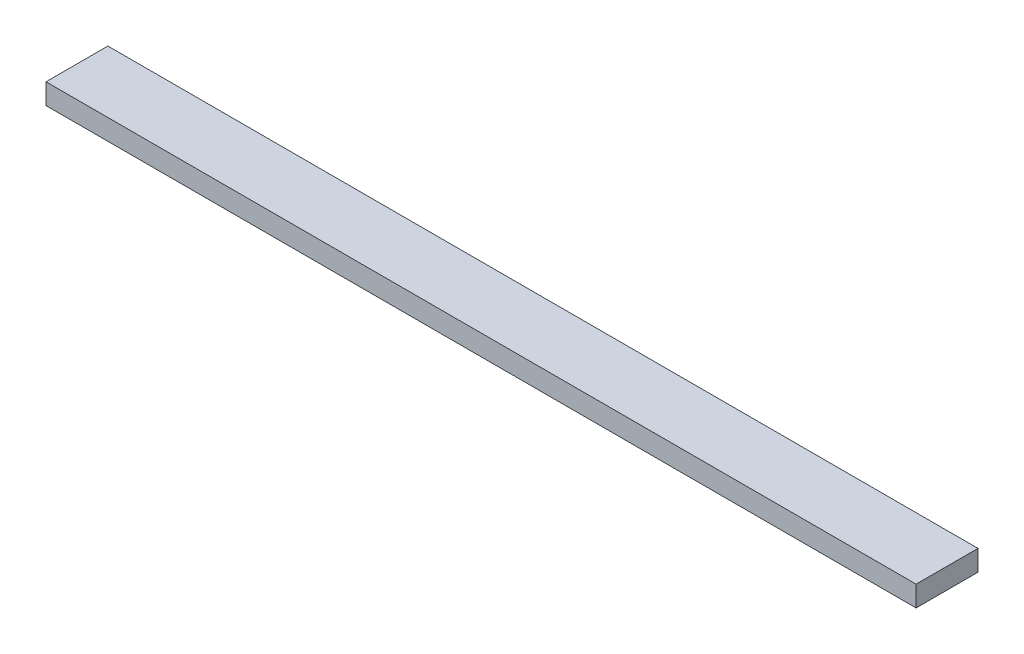
ISO-10303-21;
HEADER;
FILE_DESCRIPTION(('STEP AP214'),'2;1');
FILE_NAME('part.step','',(''),(''),'','','');
FILE_SCHEMA(('AUTOMOTIVE_DESIGN { 1 0 10303 214 1 1 1 1 }'));
ENDSEC;
DATA;
#1=APPLICATION_CONTEXT('core data for automotive mechanical design processes');
#2=APPLICATION_PROTOCOL_DEFINITION('international standard','automotive_design',2000,#1);
#3=PRODUCT_CONTEXT('',#1,'mechanical');
#4=PRODUCT('Part','Part','',(#3));
#5=PRODUCT_RELATED_PRODUCT_CATEGORY('part','',(#4));
#6=PRODUCT_DEFINITION_FORMATION('','',#4);
#7=PRODUCT_DEFINITION_CONTEXT('part definition',#1,'design');
#8=PRODUCT_DEFINITION('design','',#6,#7);
#9=PRODUCT_DEFINITION_SHAPE('','',#8);
#10=(LENGTH_UNIT() NAMED_UNIT(*) SI_UNIT(.MILLI.,.METRE.));
#11=(NAMED_UNIT(*) PLANE_ANGLE_UNIT() SI_UNIT($,.RADIAN.));
#12=(NAMED_UNIT(*) SI_UNIT($,.STERADIAN.) SOLID_ANGLE_UNIT());
#13=UNCERTAINTY_MEASURE_WITH_UNIT(LENGTH_MEASURE(1.E-05),#10,'distance_accuracy_value','');
#14=(GEOMETRIC_REPRESENTATION_CONTEXT(3) GLOBAL_UNCERTAINTY_ASSIGNED_CONTEXT((#13)) GLOBAL_UNIT_ASSIGNED_CONTEXT((#10,
#11,#12)) REPRESENTATION_CONTEXT('',''));
#15=CARTESIAN_POINT('',(0.,0.,0.));
#16=DIRECTION('',(0.,0.,1.));
#17=DIRECTION('',(1.,0.,0.));
#18=AXIS2_PLACEMENT_3D('',#15,#16,#17);
#19=CARTESIAN_POINT('',(-65.6626787533611,4.5,20.));
#20=DIRECTION('',(0.,0.,1.));
#21=DIRECTION('',(1.,0.,0.));
#22=AXIS2_PLACEMENT_3D('',#19,#20,#21);
#23=PLANE('',#22);
#24=DIRECTION('',(1.,0.,0.));
#25=VECTOR('',#24,1.);
#26=CARTESIAN_POINT('',(-70.8318530717959,0.,20.));
#27=LINE('',#26,#25);
#28=CARTESIAN_POINT('',(-70.8318530717959,0.,20.));
#29=VERTEX_POINT('',#28);
#30=CARTESIAN_POINT('',(97.8318530717959,0.,20.));
#31=VERTEX_POINT('',#30);
#32=EDGE_CURVE('E72',#29,#31,#27,.T.);
#33=ORIENTED_EDGE('',*,*,#32,.T.);
#34=DIRECTION('',(0.,-1.,0.));
#35=VECTOR('',#34,1.);
#36=CARTESIAN_POINT('',(97.8318530717959,4.,20.));
#37=LINE('',#36,#35);
#38=CARTESIAN_POINT('',(97.8318530717959,4.,20.));
#39=VERTEX_POINT('',#38);
#40=EDGE_CURVE('E92',#39,#31,#37,.T.);
#41=ORIENTED_EDGE('',*,*,#40,.F.);
#42=DIRECTION('',(-1.,0.,0.));
#43=VECTOR('',#42,1.);
#44=CARTESIAN_POINT('',(-65.6626787533611,4.,20.));
#45=LINE('',#44,#43);
#46=CARTESIAN_POINT('',(-70.8318530717959,4.,20.));
#47=VERTEX_POINT('',#46);
#48=EDGE_CURVE('E41',#39,#47,#45,.T.);
#49=ORIENTED_EDGE('',*,*,#48,.T.);
#50=DIRECTION('',(0.,1.,0.));
#51=VECTOR('',#50,1.);
#52=CARTESIAN_POINT('',(-70.8318530717959,4.,20.));
#53=LINE('',#52,#51);
#54=EDGE_CURVE('E87',#29,#47,#53,.T.);
#55=ORIENTED_EDGE('',*,*,#54,.F.);
#56=EDGE_LOOP('',(#33,#41,#49,#55));
#57=FACE_BOUND('',#56,.T.);
#58=ADVANCED_FACE('F33',(#57),#23,.T.);
#59=CARTESIAN_POINT('',(-77.8318530717959,4.,10.));
#60=DIRECTION('',(0.,-1.,0.));
#61=DIRECTION('',(0.,0.,-1.));
#62=AXIS2_PLACEMENT_3D('',#59,#60,#61);
#63=PLANE('',#62);
#64=ORIENTED_EDGE('',*,*,#48,.F.);
#65=DIRECTION('',(0.,0.,1.));
#66=VECTOR('',#65,1.);
#67=CARTESIAN_POINT('',(97.8318530717959,4.,20.));
#68=LINE('',#67,#66);
#69=CARTESIAN_POINT('',(97.8318530717959,4.,8.));
#70=VERTEX_POINT('',#69);
#71=EDGE_CURVE('E99',#70,#39,#68,.T.);
#72=ORIENTED_EDGE('',*,*,#71,.F.);
#73=DIRECTION('',(-1.,0.,0.));
#74=VECTOR('',#73,1.);
#75=CARTESIAN_POINT('',(-77.8318530717959,4.,8.));
#76=LINE('',#75,#74);
#77=CARTESIAN_POINT('',(-70.8318530717959,4.,8.));
#78=VERTEX_POINT('',#77);
#79=EDGE_CURVE('E90',#70,#78,#76,.T.);
#80=ORIENTED_EDGE('',*,*,#79,.T.);
#81=DIRECTION('',(0.,0.,-1.));
#82=VECTOR('',#81,1.);
#83=CARTESIAN_POINT('',(-70.8318530717959,4.,0.));
#84=LINE('',#83,#82);
#85=EDGE_CURVE('E89',#47,#78,#84,.T.);
#86=ORIENTED_EDGE('',*,*,#85,.F.);
#87=EDGE_LOOP('',(#64,#72,#80,#86));
#88=FACE_BOUND('',#87,.T.);
#89=ADVANCED_FACE('F35',(#88),#63,.F.);
#90=CARTESIAN_POINT('',(97.8318530717959,0.,0.));
#91=DIRECTION('',(1.,0.,0.));
#92=DIRECTION('',(0.,0.,-1.));
#93=AXIS2_PLACEMENT_3D('',#90,#91,#92);
#94=PLANE('',#93);
#95=DIRECTION('',(0.,0.,1.));
#96=VECTOR('',#95,1.);
#97=CARTESIAN_POINT('',(97.8318530717959,0.,20.));
#98=LINE('',#97,#96);
#99=CARTESIAN_POINT('',(97.8318530717959,0.,8.));
#100=VERTEX_POINT('',#99);
#101=EDGE_CURVE('E75',#100,#31,#98,.T.);
#102=ORIENTED_EDGE('',*,*,#101,.F.);
#103=DIRECTION('',(0.,-1.,0.));
#104=VECTOR('',#103,1.);
#105=CARTESIAN_POINT('',(97.8318530717959,-5.,8.));
#106=LINE('',#105,#104);
#107=EDGE_CURVE('E80',#70,#100,#106,.T.);
#108=ORIENTED_EDGE('',*,*,#107,.F.);
#109=ORIENTED_EDGE('',*,*,#71,.T.);
#110=ORIENTED_EDGE('',*,*,#40,.T.);
#111=EDGE_LOOP('',(#102,#108,#109,#110));
#112=FACE_BOUND('',#111,.T.);
#113=ADVANCED_FACE('F102',(#112),#94,.T.);
#114=CARTESIAN_POINT('',(-70.8318530717959,0.,0.));
#115=DIRECTION('',(-1.,0.,0.));
#116=DIRECTION('',(0.,0.,1.));
#117=AXIS2_PLACEMENT_3D('',#114,#115,#116);
#118=PLANE('',#117);
#119=DIRECTION('',(0.,0.,1.));
#120=VECTOR('',#119,1.);
#121=CARTESIAN_POINT('',(-70.8318530717959,0.,20.));
#122=LINE('',#121,#120);
#123=CARTESIAN_POINT('',(-70.8318530717959,0.,8.));
#124=VERTEX_POINT('',#123);
#125=EDGE_CURVE('E48',#124,#29,#122,.T.);
#126=ORIENTED_EDGE('',*,*,#125,.T.);
#127=ORIENTED_EDGE('',*,*,#54,.T.);
#128=ORIENTED_EDGE('',*,*,#85,.T.);
#129=DIRECTION('',(0.,1.,0.));
#130=VECTOR('',#129,1.);
#131=CARTESIAN_POINT('',(-70.8318530717959,0.,8.));
#132=LINE('',#131,#130);
#133=EDGE_CURVE('E11',#124,#78,#132,.T.);
#134=ORIENTED_EDGE('',*,*,#133,.F.);
#135=EDGE_LOOP('',(#126,#127,#128,#134));
#136=FACE_BOUND('',#135,.T.);
#137=ADVANCED_FACE('F85',(#136),#118,.T.);
#138=CARTESIAN_POINT('',(0.,0.,8.));
#139=DIRECTION('',(0.,0.,1.));
#140=DIRECTION('',(1.,0.,0.));
#141=AXIS2_PLACEMENT_3D('',#138,#139,#140);
#142=PLANE('',#141);
#143=ORIENTED_EDGE('',*,*,#107,.T.);
#144=DIRECTION('',(1.,0.,0.));
#145=VECTOR('',#144,1.);
#146=CARTESIAN_POINT('',(-70.8318530717959,0.,8.));
#147=LINE('',#146,#145);
#148=EDGE_CURVE('E81',#124,#100,#147,.T.);
#149=ORIENTED_EDGE('',*,*,#148,.F.);
#150=ORIENTED_EDGE('',*,*,#133,.T.);
#151=ORIENTED_EDGE('',*,*,#79,.F.);
#152=EDGE_LOOP('',(#143,#149,#150,#151));
#153=FACE_BOUND('',#152,.T.);
#154=ADVANCED_FACE('F105',(#153),#142,.F.);
#155=CARTESIAN_POINT('',(-70.8318530717959,0.,20.));
#156=DIRECTION('',(0.,1.,0.));
#157=DIRECTION('',(0.,0.,1.));
#158=AXIS2_PLACEMENT_3D('',#155,#156,#157);
#159=PLANE('',#158);
#160=ORIENTED_EDGE('',*,*,#101,.T.);
#161=ORIENTED_EDGE('',*,*,#32,.F.);
#162=ORIENTED_EDGE('',*,*,#125,.F.);
#163=ORIENTED_EDGE('',*,*,#148,.T.);
#164=EDGE_LOOP('',(#160,#161,#162,#163));
#165=FACE_BOUND('',#164,.T.);
#166=ADVANCED_FACE('F73',(#165),#159,.F.);
#167=CLOSED_SHELL('',(#58,#89,#113,#137,#154,#166));
#168=MANIFOLD_SOLID_BREP('B2',#167);
#169=ADVANCED_BREP_SHAPE_REPRESENTATION('',(#18,#168),#14);
#170=SHAPE_DEFINITION_REPRESENTATION(#9,#169);
ENDSEC;
END-ISO-10303-21;
